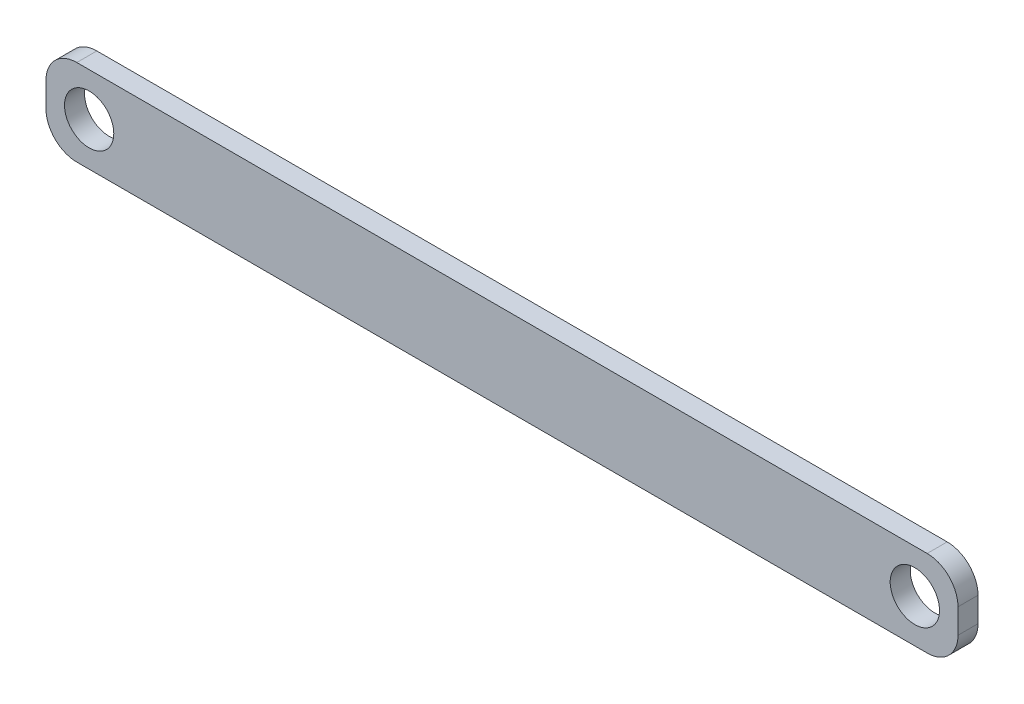
ISO-10303-21;
HEADER;
FILE_DESCRIPTION(('STEP AP214'),'2;1');
FILE_NAME('part.step','',(''),(''),'','','');
FILE_SCHEMA(('AUTOMOTIVE_DESIGN { 1 0 10303 214 1 1 1 1 }'));
ENDSEC;
DATA;
#1=APPLICATION_CONTEXT('core data for automotive mechanical design processes');
#2=APPLICATION_PROTOCOL_DEFINITION('international standard','automotive_design',2000,#1);
#3=PRODUCT_CONTEXT('',#1,'mechanical');
#4=PRODUCT('Part','Part','',(#3));
#5=PRODUCT_RELATED_PRODUCT_CATEGORY('part','',(#4));
#6=PRODUCT_DEFINITION_FORMATION('','',#4);
#7=PRODUCT_DEFINITION_CONTEXT('part definition',#1,'design');
#8=PRODUCT_DEFINITION('design','',#6,#7);
#9=PRODUCT_DEFINITION_SHAPE('','',#8);
#10=(LENGTH_UNIT() NAMED_UNIT(*) SI_UNIT(.MILLI.,.METRE.));
#11=(NAMED_UNIT(*) PLANE_ANGLE_UNIT() SI_UNIT($,.RADIAN.));
#12=(NAMED_UNIT(*) SI_UNIT($,.STERADIAN.) SOLID_ANGLE_UNIT());
#13=UNCERTAINTY_MEASURE_WITH_UNIT(LENGTH_MEASURE(1.E-05),#10,'distance_accuracy_value','');
#14=(GEOMETRIC_REPRESENTATION_CONTEXT(3) GLOBAL_UNCERTAINTY_ASSIGNED_CONTEXT((#13)) GLOBAL_UNIT_ASSIGNED_CONTEXT((#10,
#11,#12)) REPRESENTATION_CONTEXT('',''));
#15=CARTESIAN_POINT('',(0.,0.,0.));
#16=DIRECTION('',(0.,0.,1.));
#17=DIRECTION('',(1.,0.,0.));
#18=AXIS2_PLACEMENT_3D('',#15,#16,#17);
#19=CARTESIAN_POINT('',(0.,0.,6.5));
#20=DIRECTION('',(0.,0.,-1.));
#21=DIRECTION('',(-1.,0.,0.));
#22=AXIS2_PLACEMENT_3D('',#19,#20,#21);
#23=PLANE('',#22);
#24=DIRECTION('',(0.,-1.,0.));
#25=VECTOR('',#24,1.);
#26=CARTESIAN_POINT('',(-148.,-14.,6.5));
#27=LINE('',#26,#25);
#28=CARTESIAN_POINT('',(-148.,4.,6.5));
#29=VERTEX_POINT('',#28);
#30=CARTESIAN_POINT('',(-148.,-4.,6.5));
#31=VERTEX_POINT('',#30);
#32=EDGE_CURVE('E200',#29,#31,#27,.T.);
#33=ORIENTED_EDGE('',*,*,#32,.T.);
#34=CARTESIAN_POINT('',(-138.,-4.,6.5));
#35=DIRECTION('',(0.,0.,-1.));
#36=DIRECTION('',(-1.,0.,0.));
#37=AXIS2_PLACEMENT_3D('',#34,#35,#36);
#38=CIRCLE('',#37,10.);
#39=CARTESIAN_POINT('',(-138.,-14.,6.5));
#40=VERTEX_POINT('',#39);
#41=EDGE_CURVE('E170',#31,#40,#38,.F.);
#42=ORIENTED_EDGE('',*,*,#41,.T.);
#43=DIRECTION('',(1.,0.,0.));
#44=VECTOR('',#43,1.);
#45=CARTESIAN_POINT('',(-148.,-14.,6.5));
#46=LINE('',#45,#44);
#47=CARTESIAN_POINT('',(138.,-14.,6.5));
#48=VERTEX_POINT('',#47);
#49=EDGE_CURVE('E128',#40,#48,#46,.T.);
#50=ORIENTED_EDGE('',*,*,#49,.T.);
#51=CARTESIAN_POINT('',(138.,-4.,6.5));
#52=DIRECTION('',(0.,0.,-1.));
#53=DIRECTION('',(-1.,0.,0.));
#54=AXIS2_PLACEMENT_3D('',#51,#52,#53);
#55=CIRCLE('',#54,10.);
#56=CARTESIAN_POINT('',(148.,-4.,6.5));
#57=VERTEX_POINT('',#56);
#58=EDGE_CURVE('E164',#48,#57,#55,.F.);
#59=ORIENTED_EDGE('',*,*,#58,.T.);
#60=DIRECTION('',(0.,1.,0.));
#61=VECTOR('',#60,1.);
#62=CARTESIAN_POINT('',(148.,-14.,6.5));
#63=LINE('',#62,#61);
#64=CARTESIAN_POINT('',(148.,4.,6.5));
#65=VERTEX_POINT('',#64);
#66=EDGE_CURVE('E138',#57,#65,#63,.T.);
#67=ORIENTED_EDGE('',*,*,#66,.T.);
#68=CARTESIAN_POINT('',(138.,4.,6.5));
#69=DIRECTION('',(0.,0.,-1.));
#70=DIRECTION('',(-1.,0.,0.));
#71=AXIS2_PLACEMENT_3D('',#68,#69,#70);
#72=CIRCLE('',#71,10.);
#73=CARTESIAN_POINT('',(138.,14.,6.5));
#74=VERTEX_POINT('',#73);
#75=EDGE_CURVE('E62',#65,#74,#72,.F.);
#76=ORIENTED_EDGE('',*,*,#75,.T.);
#77=DIRECTION('',(-1.,0.,0.));
#78=VECTOR('',#77,1.);
#79=CARTESIAN_POINT('',(-148.,14.,6.5));
#80=LINE('',#79,#78);
#81=CARTESIAN_POINT('',(-138.,14.,6.5));
#82=VERTEX_POINT('',#81);
#83=EDGE_CURVE('E143',#74,#82,#80,.T.);
#84=ORIENTED_EDGE('',*,*,#83,.T.);
#85=CARTESIAN_POINT('',(-138.,4.,6.5));
#86=DIRECTION('',(0.,0.,-1.));
#87=DIRECTION('',(-1.,0.,0.));
#88=AXIS2_PLACEMENT_3D('',#85,#86,#87);
#89=CIRCLE('',#88,10.);
#90=EDGE_CURVE('E167',#82,#29,#89,.F.);
#91=ORIENTED_EDGE('',*,*,#90,.T.);
#92=EDGE_LOOP('',(#33,#42,#50,#59,#67,#76,#84,#91));
#93=FACE_BOUND('',#92,.T.);
#94=CARTESIAN_POINT('',(-134.,0.,6.5));
#95=DIRECTION('',(0.,0.,1.));
#96=DIRECTION('',(1.,0.,0.));
#97=AXIS2_PLACEMENT_3D('',#94,#95,#96);
#98=CIRCLE('',#97,8.00000000000001);
#99=CARTESIAN_POINT('',(-126.,0.,6.5));
#100=VERTEX_POINT('',#99);
#101=EDGE_CURVE('E195',#100,#100,#98,.T.);
#102=ORIENTED_EDGE('',*,*,#101,.F.);
#103=EDGE_LOOP('',(#102));
#104=FACE_BOUND('',#103,.T.);
#105=CARTESIAN_POINT('',(134.,0.,6.5));
#106=DIRECTION('',(0.,0.,1.));
#107=DIRECTION('',(1.,0.,0.));
#108=AXIS2_PLACEMENT_3D('',#105,#106,#107);
#109=CIRCLE('',#108,8.00000000000001);
#110=CARTESIAN_POINT('',(142.,0.,6.5));
#111=VERTEX_POINT('',#110);
#112=EDGE_CURVE('E209',#111,#111,#109,.T.);
#113=ORIENTED_EDGE('',*,*,#112,.F.);
#114=EDGE_LOOP('',(#113));
#115=FACE_BOUND('',#114,.T.);
#116=ADVANCED_FACE('F39',(#93,#104,#115),#23,.F.);
#117=CARTESIAN_POINT('',(0.,0.,0.));
#118=DIRECTION('',(0.,0.,-1.));
#119=DIRECTION('',(-1.,0.,0.));
#120=AXIS2_PLACEMENT_3D('',#117,#118,#119);
#121=PLANE('',#120);
#122=CARTESIAN_POINT('',(-134.,0.,0.));
#123=DIRECTION('',(0.,0.,1.));
#124=DIRECTION('',(1.,0.,0.));
#125=AXIS2_PLACEMENT_3D('',#122,#123,#124);
#126=CIRCLE('',#125,8.00000000000001);
#127=CARTESIAN_POINT('',(-126.,0.,0.));
#128=VERTEX_POINT('',#127);
#129=EDGE_CURVE('E205',#128,#128,#126,.T.);
#130=ORIENTED_EDGE('',*,*,#129,.T.);
#131=EDGE_LOOP('',(#130));
#132=FACE_BOUND('',#131,.T.);
#133=DIRECTION('',(1.,0.,0.));
#134=VECTOR('',#133,1.);
#135=CARTESIAN_POINT('',(-148.,-14.,0.));
#136=LINE('',#135,#134);
#137=CARTESIAN_POINT('',(-138.,-14.,0.));
#138=VERTEX_POINT('',#137);
#139=CARTESIAN_POINT('',(138.,-14.,0.));
#140=VERTEX_POINT('',#139);
#141=EDGE_CURVE('E125',#138,#140,#136,.T.);
#142=ORIENTED_EDGE('',*,*,#141,.F.);
#143=CARTESIAN_POINT('',(-138.,-4.,0.));
#144=DIRECTION('',(0.,0.,-1.));
#145=DIRECTION('',(-1.,0.,0.));
#146=AXIS2_PLACEMENT_3D('',#143,#144,#145);
#147=CIRCLE('',#146,10.);
#148=CARTESIAN_POINT('',(-148.,-4.,0.));
#149=VERTEX_POINT('',#148);
#150=EDGE_CURVE('E107',#138,#149,#147,.T.);
#151=ORIENTED_EDGE('',*,*,#150,.T.);
#152=DIRECTION('',(0.,-1.,0.));
#153=VECTOR('',#152,1.);
#154=CARTESIAN_POINT('',(-148.,-14.,0.));
#155=LINE('',#154,#153);
#156=CARTESIAN_POINT('',(-148.,4.,0.));
#157=VERTEX_POINT('',#156);
#158=EDGE_CURVE('E139',#157,#149,#155,.T.);
#159=ORIENTED_EDGE('',*,*,#158,.F.);
#160=CARTESIAN_POINT('',(-138.,4.,0.));
#161=DIRECTION('',(0.,0.,-1.));
#162=DIRECTION('',(-1.,0.,0.));
#163=AXIS2_PLACEMENT_3D('',#160,#161,#162);
#164=CIRCLE('',#163,10.);
#165=CARTESIAN_POINT('',(-138.,14.,0.));
#166=VERTEX_POINT('',#165);
#167=EDGE_CURVE('E119',#157,#166,#164,.T.);
#168=ORIENTED_EDGE('',*,*,#167,.T.);
#169=DIRECTION('',(-1.,0.,0.));
#170=VECTOR('',#169,1.);
#171=CARTESIAN_POINT('',(-148.,14.,0.));
#172=LINE('',#171,#170);
#173=CARTESIAN_POINT('',(138.,14.,0.));
#174=VERTEX_POINT('',#173);
#175=EDGE_CURVE('E145',#174,#166,#172,.T.);
#176=ORIENTED_EDGE('',*,*,#175,.F.);
#177=CARTESIAN_POINT('',(138.,4.,0.));
#178=DIRECTION('',(0.,0.,-1.));
#179=DIRECTION('',(-1.,0.,0.));
#180=AXIS2_PLACEMENT_3D('',#177,#178,#179);
#181=CIRCLE('',#180,10.);
#182=CARTESIAN_POINT('',(148.,4.,0.));
#183=VERTEX_POINT('',#182);
#184=EDGE_CURVE('E130',#174,#183,#181,.T.);
#185=ORIENTED_EDGE('',*,*,#184,.T.);
#186=DIRECTION('',(0.,1.,0.));
#187=VECTOR('',#186,1.);
#188=CARTESIAN_POINT('',(148.,-14.,0.));
#189=LINE('',#188,#187);
#190=CARTESIAN_POINT('',(148.,-4.,0.));
#191=VERTEX_POINT('',#190);
#192=EDGE_CURVE('E185',#191,#183,#189,.T.);
#193=ORIENTED_EDGE('',*,*,#192,.F.);
#194=CARTESIAN_POINT('',(138.,-4.,0.));
#195=DIRECTION('',(0.,0.,-1.));
#196=DIRECTION('',(-1.,0.,0.));
#197=AXIS2_PLACEMENT_3D('',#194,#195,#196);
#198=CIRCLE('',#197,10.);
#199=EDGE_CURVE('E136',#191,#140,#198,.T.);
#200=ORIENTED_EDGE('',*,*,#199,.T.);
#201=EDGE_LOOP('',(#142,#151,#159,#168,#176,#185,#193,#200));
#202=FACE_BOUND('',#201,.T.);
#203=CARTESIAN_POINT('',(134.,0.,0.));
#204=DIRECTION('',(0.,0.,1.));
#205=DIRECTION('',(1.,0.,0.));
#206=AXIS2_PLACEMENT_3D('',#203,#204,#205);
#207=CIRCLE('',#206,8.00000000000001);
#208=CARTESIAN_POINT('',(142.,0.,0.));
#209=VERTEX_POINT('',#208);
#210=EDGE_CURVE('E213',#209,#209,#207,.T.);
#211=ORIENTED_EDGE('',*,*,#210,.T.);
#212=EDGE_LOOP('',(#211));
#213=FACE_BOUND('',#212,.T.);
#214=ADVANCED_FACE('F133',(#132,#202,#213),#121,.T.);
#215=CARTESIAN_POINT('',(148.,-14.,6.5));
#216=DIRECTION('',(-1.,0.,0.));
#217=DIRECTION('',(0.,0.,1.));
#218=AXIS2_PLACEMENT_3D('',#215,#216,#217);
#219=PLANE('',#218);
#220=ORIENTED_EDGE('',*,*,#66,.F.);
#221=DIRECTION('',(0.,0.,-1.));
#222=VECTOR('',#221,1.);
#223=CARTESIAN_POINT('',(148.,-4.,6.5));
#224=LINE('',#223,#222);
#225=EDGE_CURVE('E11',#57,#191,#224,.T.);
#226=ORIENTED_EDGE('',*,*,#225,.T.);
#227=ORIENTED_EDGE('',*,*,#192,.T.);
#228=DIRECTION('',(0.,0.,-1.));
#229=VECTOR('',#228,1.);
#230=CARTESIAN_POINT('',(148.,4.,6.5));
#231=LINE('',#230,#229);
#232=EDGE_CURVE('E48',#183,#65,#231,.F.);
#233=ORIENTED_EDGE('',*,*,#232,.T.);
#234=EDGE_LOOP('',(#220,#226,#227,#233));
#235=FACE_BOUND('',#234,.T.);
#236=ADVANCED_FACE('F183',(#235),#219,.F.);
#237=CARTESIAN_POINT('',(-148.,14.,6.5));
#238=DIRECTION('',(0.,-1.,0.));
#239=DIRECTION('',(0.,0.,-1.));
#240=AXIS2_PLACEMENT_3D('',#237,#238,#239);
#241=PLANE('',#240);
#242=ORIENTED_EDGE('',*,*,#175,.T.);
#243=DIRECTION('',(0.,0.,-1.));
#244=VECTOR('',#243,1.);
#245=CARTESIAN_POINT('',(-138.,14.,6.5));
#246=LINE('',#245,#244);
#247=EDGE_CURVE('E55',#166,#82,#246,.F.);
#248=ORIENTED_EDGE('',*,*,#247,.T.);
#249=ORIENTED_EDGE('',*,*,#83,.F.);
#250=DIRECTION('',(0.,0.,-1.));
#251=VECTOR('',#250,1.);
#252=CARTESIAN_POINT('',(138.,14.,6.5));
#253=LINE('',#252,#251);
#254=EDGE_CURVE('E173',#74,#174,#253,.T.);
#255=ORIENTED_EDGE('',*,*,#254,.T.);
#256=EDGE_LOOP('',(#242,#248,#249,#255));
#257=FACE_BOUND('',#256,.T.);
#258=ADVANCED_FACE('F192',(#257),#241,.F.);
#259=CARTESIAN_POINT('',(-148.,-14.,6.5));
#260=DIRECTION('',(1.,0.,0.));
#261=DIRECTION('',(0.,0.,-1.));
#262=AXIS2_PLACEMENT_3D('',#259,#260,#261);
#263=PLANE('',#262);
#264=ORIENTED_EDGE('',*,*,#158,.T.);
#265=DIRECTION('',(0.,0.,-1.));
#266=VECTOR('',#265,1.);
#267=CARTESIAN_POINT('',(-148.,-4.,6.5));
#268=LINE('',#267,#266);
#269=EDGE_CURVE('E112',#149,#31,#268,.F.);
#270=ORIENTED_EDGE('',*,*,#269,.T.);
#271=ORIENTED_EDGE('',*,*,#32,.F.);
#272=DIRECTION('',(0.,0.,-1.));
#273=VECTOR('',#272,1.);
#274=CARTESIAN_POINT('',(-148.,4.,6.5));
#275=LINE('',#274,#273);
#276=EDGE_CURVE('E118',#29,#157,#275,.T.);
#277=ORIENTED_EDGE('',*,*,#276,.T.);
#278=EDGE_LOOP('',(#264,#270,#271,#277));
#279=FACE_BOUND('',#278,.T.);
#280=ADVANCED_FACE('F237',(#279),#263,.F.);
#281=CARTESIAN_POINT('',(-148.,-14.,6.5));
#282=DIRECTION('',(0.,1.,0.));
#283=DIRECTION('',(0.,0.,1.));
#284=AXIS2_PLACEMENT_3D('',#281,#282,#283);
#285=PLANE('',#284);
#286=ORIENTED_EDGE('',*,*,#49,.F.);
#287=DIRECTION('',(0.,0.,-1.));
#288=VECTOR('',#287,1.);
#289=CARTESIAN_POINT('',(-138.,-14.,6.5));
#290=LINE('',#289,#288);
#291=EDGE_CURVE('E111',#40,#138,#290,.T.);
#292=ORIENTED_EDGE('',*,*,#291,.T.);
#293=ORIENTED_EDGE('',*,*,#141,.T.);
#294=DIRECTION('',(0.,0.,-1.));
#295=VECTOR('',#294,1.);
#296=CARTESIAN_POINT('',(138.,-14.,6.5));
#297=LINE('',#296,#295);
#298=EDGE_CURVE('E131',#140,#48,#297,.F.);
#299=ORIENTED_EDGE('',*,*,#298,.T.);
#300=EDGE_LOOP('',(#286,#292,#293,#299));
#301=FACE_BOUND('',#300,.T.);
#302=ADVANCED_FACE('F124',(#301),#285,.F.);
#303=CARTESIAN_POINT('',(-134.,0.,6.5));
#304=DIRECTION('',(0.,0.,-1.));
#305=DIRECTION('',(-1.,0.,0.));
#306=AXIS2_PLACEMENT_3D('',#303,#304,#305);
#307=CYLINDRICAL_SURFACE('',#306,8.00000000000001);
#308=ORIENTED_EDGE('',*,*,#101,.T.);
#309=EDGE_LOOP('',(#308));
#310=FACE_BOUND('',#309,.T.);
#311=ORIENTED_EDGE('',*,*,#129,.F.);
#312=EDGE_LOOP('',(#311));
#313=FACE_BOUND('',#312,.T.);
#314=ADVANCED_FACE('F232',(#310,#313),#307,.F.);
#315=CARTESIAN_POINT('',(134.,0.,6.5));
#316=DIRECTION('',(0.,0.,-1.));
#317=DIRECTION('',(-1.,0.,0.));
#318=AXIS2_PLACEMENT_3D('',#315,#316,#317);
#319=CYLINDRICAL_SURFACE('',#318,8.00000000000001);
#320=ORIENTED_EDGE('',*,*,#112,.T.);
#321=EDGE_LOOP('',(#320));
#322=FACE_BOUND('',#321,.T.);
#323=ORIENTED_EDGE('',*,*,#210,.F.);
#324=EDGE_LOOP('',(#323));
#325=FACE_BOUND('',#324,.T.);
#326=ADVANCED_FACE('F221',(#322,#325),#319,.F.);
#327=CARTESIAN_POINT('',(-138.,-4.,6.5));
#328=DIRECTION('',(0.,0.,-1.));
#329=DIRECTION('',(-1.,0.,0.));
#330=AXIS2_PLACEMENT_3D('',#327,#328,#329);
#331=CYLINDRICAL_SURFACE('',#330,10.);
#332=ORIENTED_EDGE('',*,*,#41,.F.);
#333=ORIENTED_EDGE('',*,*,#269,.F.);
#334=ORIENTED_EDGE('',*,*,#150,.F.);
#335=ORIENTED_EDGE('',*,*,#291,.F.);
#336=EDGE_LOOP('',(#332,#333,#334,#335));
#337=FACE_BOUND('',#336,.T.);
#338=ADVANCED_FACE('F110',(#337),#331,.T.);
#339=CARTESIAN_POINT('',(-138.,4.,6.5));
#340=DIRECTION('',(0.,0.,-1.));
#341=DIRECTION('',(-1.,0.,0.));
#342=AXIS2_PLACEMENT_3D('',#339,#340,#341);
#343=CYLINDRICAL_SURFACE('',#342,10.);
#344=ORIENTED_EDGE('',*,*,#90,.F.);
#345=ORIENTED_EDGE('',*,*,#247,.F.);
#346=ORIENTED_EDGE('',*,*,#167,.F.);
#347=ORIENTED_EDGE('',*,*,#276,.F.);
#348=EDGE_LOOP('',(#344,#345,#346,#347));
#349=FACE_BOUND('',#348,.T.);
#350=ADVANCED_FACE('F247',(#349),#343,.T.);
#351=CARTESIAN_POINT('',(138.,-4.,6.5));
#352=DIRECTION('',(0.,0.,-1.));
#353=DIRECTION('',(-1.,0.,0.));
#354=AXIS2_PLACEMENT_3D('',#351,#352,#353);
#355=CYLINDRICAL_SURFACE('',#354,10.);
#356=ORIENTED_EDGE('',*,*,#58,.F.);
#357=ORIENTED_EDGE('',*,*,#298,.F.);
#358=ORIENTED_EDGE('',*,*,#199,.F.);
#359=ORIENTED_EDGE('',*,*,#225,.F.);
#360=EDGE_LOOP('',(#356,#357,#358,#359));
#361=FACE_BOUND('',#360,.T.);
#362=ADVANCED_FACE('F249',(#361),#355,.T.);
#363=CARTESIAN_POINT('',(138.,4.,6.5));
#364=DIRECTION('',(0.,0.,-1.));
#365=DIRECTION('',(-1.,0.,0.));
#366=AXIS2_PLACEMENT_3D('',#363,#364,#365);
#367=CYLINDRICAL_SURFACE('',#366,10.);
#368=ORIENTED_EDGE('',*,*,#75,.F.);
#369=ORIENTED_EDGE('',*,*,#232,.F.);
#370=ORIENTED_EDGE('',*,*,#184,.F.);
#371=ORIENTED_EDGE('',*,*,#254,.F.);
#372=EDGE_LOOP('',(#368,#369,#370,#371));
#373=FACE_BOUND('',#372,.T.);
#374=ADVANCED_FACE('F41',(#373),#367,.T.);
#375=CLOSED_SHELL('',(#116,#214,#236,#258,#280,#302,#314,#326,#338,#350,#362,#374));
#376=MANIFOLD_SOLID_BREP('B2',#375);
#377=ADVANCED_BREP_SHAPE_REPRESENTATION('',(#18,#376),#14);
#378=SHAPE_DEFINITION_REPRESENTATION(#9,#377);
ENDSEC;
END-ISO-10303-21;
